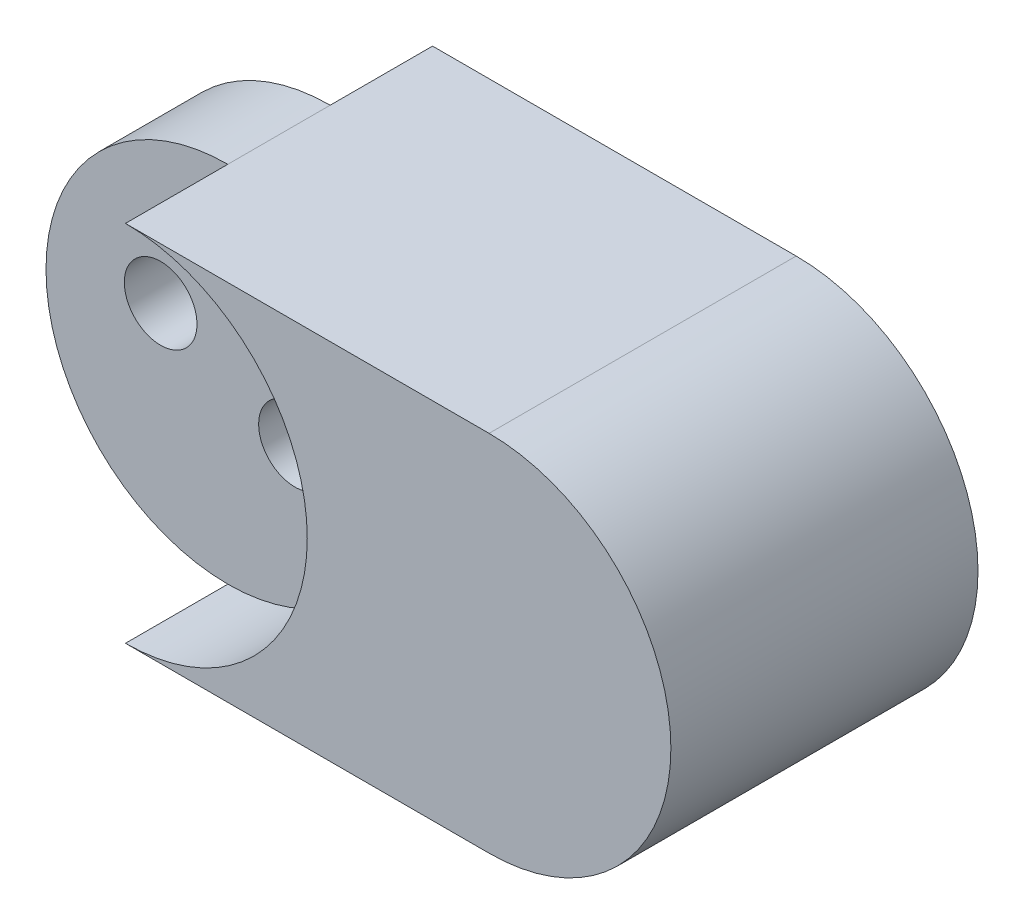
ISO-10303-21;
HEADER;
FILE_DESCRIPTION(('STEP AP214'),'2;1');
FILE_NAME('part.step','',(''),(''),'','','');
FILE_SCHEMA(('AUTOMOTIVE_DESIGN { 1 0 10303 214 1 1 1 1 }'));
ENDSEC;
DATA;
#1=APPLICATION_CONTEXT('core data for automotive mechanical design processes');
#2=APPLICATION_PROTOCOL_DEFINITION('international standard','automotive_design',2000,#1);
#3=PRODUCT_CONTEXT('',#1,'mechanical');
#4=PRODUCT('Part','Part','',(#3));
#5=PRODUCT_RELATED_PRODUCT_CATEGORY('part','',(#4));
#6=PRODUCT_DEFINITION_FORMATION('','',#4);
#7=PRODUCT_DEFINITION_CONTEXT('part definition',#1,'design');
#8=PRODUCT_DEFINITION('design','',#6,#7);
#9=PRODUCT_DEFINITION_SHAPE('','',#8);
#10=(LENGTH_UNIT() NAMED_UNIT(*) SI_UNIT(.MILLI.,.METRE.));
#11=(NAMED_UNIT(*) PLANE_ANGLE_UNIT() SI_UNIT($,.RADIAN.));
#12=(NAMED_UNIT(*) SI_UNIT($,.STERADIAN.) SOLID_ANGLE_UNIT());
#13=UNCERTAINTY_MEASURE_WITH_UNIT(LENGTH_MEASURE(1.E-05),#10,'distance_accuracy_value','');
#14=(GEOMETRIC_REPRESENTATION_CONTEXT(3) GLOBAL_UNCERTAINTY_ASSIGNED_CONTEXT((#13)) GLOBAL_UNIT_ASSIGNED_CONTEXT((#10,
#11,#12)) REPRESENTATION_CONTEXT('',''));
#15=CARTESIAN_POINT('',(0.,0.,0.));
#16=DIRECTION('',(0.,0.,1.));
#17=DIRECTION('',(1.,0.,0.));
#18=AXIS2_PLACEMENT_3D('',#15,#16,#17);
#19=CARTESIAN_POINT('',(-1.63988617020753,0.679263092448036,7.5));
#20=DIRECTION('',(0.,0.,-1.));
#21=DIRECTION('',(-1.,0.,0.));
#22=AXIS2_PLACEMENT_3D('',#19,#20,#21);
#23=CYLINDRICAL_SURFACE('',#22,4.44);
#24=DIRECTION('',(0.,0.,-1.));
#25=VECTOR('',#24,1.);
#26=CARTESIAN_POINT('',(-1.63988617020753,-3.76073690755197,7.5));
#27=LINE('',#26,#25);
#28=CARTESIAN_POINT('',(-1.63988617020753,-3.76073690755197,5.));
#29=VERTEX_POINT('',#28);
#30=CARTESIAN_POINT('',(-1.63988617020753,-3.76073690755197,2.5));
#31=VERTEX_POINT('',#30);
#32=EDGE_CURVE('E51',#29,#31,#27,.T.);
#33=ORIENTED_EDGE('',*,*,#32,.F.);
#34=CARTESIAN_POINT('',(-1.63988617020753,0.679263092448036,5.));
#35=DIRECTION('',(0.,0.,-1.));
#36=DIRECTION('',(-1.,0.,0.));
#37=AXIS2_PLACEMENT_3D('',#34,#35,#36);
#38=CIRCLE('',#37,4.44);
#39=CARTESIAN_POINT('',(-1.63988617020753,5.11926309244804,5.));
#40=VERTEX_POINT('',#39);
#41=EDGE_CURVE('E119',#29,#40,#38,.T.);
#42=ORIENTED_EDGE('',*,*,#41,.T.);
#43=DIRECTION('',(0.,0.,-1.));
#44=VECTOR('',#43,1.);
#45=CARTESIAN_POINT('',(-1.63988617020753,5.11926309244804,7.5));
#46=LINE('',#45,#44);
#47=CARTESIAN_POINT('',(-1.63988617020753,5.11926309244804,2.5));
#48=VERTEX_POINT('',#47);
#49=EDGE_CURVE('E58',#40,#48,#46,.T.);
#50=ORIENTED_EDGE('',*,*,#49,.T.);
#51=CARTESIAN_POINT('',(-1.63988617020753,0.679263092448036,2.5));
#52=DIRECTION('',(0.,0.,-1.));
#53=DIRECTION('',(-1.,0.,0.));
#54=AXIS2_PLACEMENT_3D('',#51,#52,#53);
#55=CIRCLE('',#54,4.44);
#56=EDGE_CURVE('E150',#31,#48,#55,.T.);
#57=ORIENTED_EDGE('',*,*,#56,.F.);
#58=EDGE_LOOP('',(#33,#42,#50,#57));
#59=FACE_BOUND('',#58,.T.);
#60=ADVANCED_FACE('F43',(#59),#23,.T.);
#61=CARTESIAN_POINT('',(0.,0.,7.5));
#62=DIRECTION('',(0.,0.,-1.));
#63=DIRECTION('',(-1.,0.,0.));
#64=AXIS2_PLACEMENT_3D('',#61,#62,#63);
#65=CYLINDRICAL_SURFACE('',#64,0.8875);
#66=CARTESIAN_POINT('',(0.,0.,5.));
#67=DIRECTION('',(0.,0.,-1.));
#68=DIRECTION('',(-1.,0.,0.));
#69=AXIS2_PLACEMENT_3D('',#66,#67,#68);
#70=CIRCLE('',#69,0.8875);
#71=CARTESIAN_POINT('',(-0.8875,0.,5.));
#72=VERTEX_POINT('',#71);
#73=EDGE_CURVE('E152',#72,#72,#70,.T.);
#74=ORIENTED_EDGE('',*,*,#73,.F.);
#75=EDGE_LOOP('',(#74));
#76=FACE_BOUND('',#75,.T.);
#77=CARTESIAN_POINT('',(0.,0.,2.5));
#78=DIRECTION('',(0.,0.,-1.));
#79=DIRECTION('',(-1.,0.,0.));
#80=AXIS2_PLACEMENT_3D('',#77,#78,#79);
#81=CIRCLE('',#80,0.8875);
#82=CARTESIAN_POINT('',(-0.8875,0.,2.5));
#83=VERTEX_POINT('',#82);
#84=EDGE_CURVE('E146',#83,#83,#81,.T.);
#85=ORIENTED_EDGE('',*,*,#84,.T.);
#86=EDGE_LOOP('',(#85));
#87=FACE_BOUND('',#86,.T.);
#88=ADVANCED_FACE('F177',(#76,#87),#65,.F.);
#89=CARTESIAN_POINT('',(-3.27977234041507,1.35852618489607,7.5));
#90=DIRECTION('',(0.,0.,-1.));
#91=DIRECTION('',(-1.,0.,0.));
#92=AXIS2_PLACEMENT_3D('',#89,#90,#91);
#93=CYLINDRICAL_SURFACE('',#92,0.8875);
#94=CARTESIAN_POINT('',(-3.27977234041507,1.35852618489607,5.));
#95=DIRECTION('',(0.,0.,-1.));
#96=DIRECTION('',(-1.,0.,0.));
#97=AXIS2_PLACEMENT_3D('',#94,#95,#96);
#98=CIRCLE('',#97,0.8875);
#99=CARTESIAN_POINT('',(-4.16727234041507,1.35852618489607,5.));
#100=VERTEX_POINT('',#99);
#101=EDGE_CURVE('E168',#100,#100,#98,.T.);
#102=ORIENTED_EDGE('',*,*,#101,.F.);
#103=EDGE_LOOP('',(#102));
#104=FACE_BOUND('',#103,.T.);
#105=CARTESIAN_POINT('',(-3.27977234041507,1.35852618489607,2.5));
#106=DIRECTION('',(0.,0.,-1.));
#107=DIRECTION('',(-1.,0.,0.));
#108=AXIS2_PLACEMENT_3D('',#105,#106,#107);
#109=CIRCLE('',#108,0.8875);
#110=CARTESIAN_POINT('',(-4.16727234041507,1.35852618489607,2.5));
#111=VERTEX_POINT('',#110);
#112=EDGE_CURVE('E46',#111,#111,#109,.T.);
#113=ORIENTED_EDGE('',*,*,#112,.T.);
#114=EDGE_LOOP('',(#113));
#115=FACE_BOUND('',#114,.T.);
#116=ADVANCED_FACE('F180',(#104,#115),#93,.F.);
#117=CARTESIAN_POINT('',(-1.63988617020753,0.679263092448036,7.5));
#118=DIRECTION('',(0.,0.,1.));
#119=DIRECTION('',(1.,0.,0.));
#120=AXIS2_PLACEMENT_3D('',#117,#118,#119);
#121=PLANE('',#120);
#122=CARTESIAN_POINT('',(-1.63988617020753,0.679263092448036,7.5));
#123=DIRECTION('',(0.,0.,-1.));
#124=DIRECTION('',(-1.,0.,0.));
#125=AXIS2_PLACEMENT_3D('',#122,#123,#124);
#126=CIRCLE('',#125,4.44);
#127=CARTESIAN_POINT('',(-1.63988617020753,5.11926309244804,7.5));
#128=VERTEX_POINT('',#127);
#129=CARTESIAN_POINT('',(-1.63988617020753,-3.76073690755197,7.5));
#130=VERTEX_POINT('',#129);
#131=EDGE_CURVE('E67',#128,#130,#126,.T.);
#132=ORIENTED_EDGE('',*,*,#131,.T.);
#133=DIRECTION('',(1.,0.,0.));
#134=VECTOR('',#133,1.);
#135=CARTESIAN_POINT('',(-1.63988617020753,-3.76073690755197,7.5));
#136=LINE('',#135,#134);
#137=CARTESIAN_POINT('',(7.24011382979247,-3.76073690755197,7.5));
#138=VERTEX_POINT('',#137);
#139=EDGE_CURVE('E88',#130,#138,#136,.T.);
#140=ORIENTED_EDGE('',*,*,#139,.T.);
#141=CARTESIAN_POINT('',(7.24011382979247,0.679263092448035,7.5));
#142=DIRECTION('',(0.,0.,1.));
#143=DIRECTION('',(1.,0.,0.));
#144=AXIS2_PLACEMENT_3D('',#141,#142,#143);
#145=CIRCLE('',#144,4.44);
#146=CARTESIAN_POINT('',(7.24011382979247,5.11926309244804,7.5));
#147=VERTEX_POINT('',#146);
#148=EDGE_CURVE('E160',#138,#147,#145,.T.);
#149=ORIENTED_EDGE('',*,*,#148,.T.);
#150=DIRECTION('',(-1.,0.,0.));
#151=VECTOR('',#150,1.);
#152=CARTESIAN_POINT('',(-1.63988617020753,5.11926309244804,7.5));
#153=LINE('',#152,#151);
#154=EDGE_CURVE('E124',#147,#128,#153,.T.);
#155=ORIENTED_EDGE('',*,*,#154,.T.);
#156=EDGE_LOOP('',(#132,#140,#149,#155));
#157=FACE_BOUND('',#156,.T.);
#158=ADVANCED_FACE('F167',(#157),#121,.T.);
#159=CARTESIAN_POINT('',(-1.63988617020753,0.679263092448036,0.));
#160=DIRECTION('',(0.,0.,1.));
#161=DIRECTION('',(1.,0.,0.));
#162=AXIS2_PLACEMENT_3D('',#159,#160,#161);
#163=PLANE('',#162);
#164=DIRECTION('',(1.,0.,0.));
#165=VECTOR('',#164,1.);
#166=CARTESIAN_POINT('',(-1.63988617020753,-3.76073690755197,0.));
#167=LINE('',#166,#165);
#168=CARTESIAN_POINT('',(-1.63988617020753,-3.76073690755197,0.));
#169=VERTEX_POINT('',#168);
#170=CARTESIAN_POINT('',(7.24011382979247,-3.76073690755197,0.));
#171=VERTEX_POINT('',#170);
#172=EDGE_CURVE('E145',#169,#171,#167,.T.);
#173=ORIENTED_EDGE('',*,*,#172,.F.);
#174=CARTESIAN_POINT('',(-1.63988617020753,0.679263092448036,0.));
#175=DIRECTION('',(0.,0.,-1.));
#176=DIRECTION('',(-1.,0.,0.));
#177=AXIS2_PLACEMENT_3D('',#174,#175,#176);
#178=CIRCLE('',#177,4.44);
#179=CARTESIAN_POINT('',(-1.63988617020753,5.11926309244804,0.));
#180=VERTEX_POINT('',#179);
#181=EDGE_CURVE('E144',#180,#169,#178,.T.);
#182=ORIENTED_EDGE('',*,*,#181,.F.);
#183=DIRECTION('',(-1.,0.,0.));
#184=VECTOR('',#183,1.);
#185=CARTESIAN_POINT('',(-1.63988617020753,5.11926309244804,0.));
#186=LINE('',#185,#184);
#187=CARTESIAN_POINT('',(7.24011382979247,5.11926309244804,0.));
#188=VERTEX_POINT('',#187);
#189=EDGE_CURVE('E127',#188,#180,#186,.T.);
#190=ORIENTED_EDGE('',*,*,#189,.F.);
#191=CARTESIAN_POINT('',(7.24011382979247,0.679263092448035,0.));
#192=DIRECTION('',(0.,0.,1.));
#193=DIRECTION('',(1.,0.,0.));
#194=AXIS2_PLACEMENT_3D('',#191,#192,#193);
#195=CIRCLE('',#194,4.44);
#196=EDGE_CURVE('E83',#171,#188,#195,.T.);
#197=ORIENTED_EDGE('',*,*,#196,.F.);
#198=EDGE_LOOP('',(#173,#182,#190,#197));
#199=FACE_BOUND('',#198,.T.);
#200=ADVANCED_FACE('F165',(#199),#163,.F.);
#201=CARTESIAN_POINT('',(-1.63988617020753,-3.76073690755197,7.5));
#202=DIRECTION('',(0.,1.,0.));
#203=DIRECTION('',(0.,0.,1.));
#204=AXIS2_PLACEMENT_3D('',#201,#202,#203);
#205=PLANE('',#204);
#206=ORIENTED_EDGE('',*,*,#172,.T.);
#207=DIRECTION('',(0.,0.,-1.));
#208=VECTOR('',#207,1.);
#209=CARTESIAN_POINT('',(7.24011382979247,-3.76073690755197,7.5));
#210=LINE('',#209,#208);
#211=EDGE_CURVE('E130',#138,#171,#210,.T.);
#212=ORIENTED_EDGE('',*,*,#211,.F.);
#213=ORIENTED_EDGE('',*,*,#139,.F.);
#214=EDGE_CURVE('E11',#130,#29,#27,.T.);
#215=ORIENTED_EDGE('',*,*,#214,.T.);
#216=ORIENTED_EDGE('',*,*,#32,.T.);
#217=DIRECTION('',(0.,0.,-1.));
#218=VECTOR('',#217,1.);
#219=CARTESIAN_POINT('',(-1.63988617020753,-3.76073690755197,2.5));
#220=LINE('',#219,#218);
#221=EDGE_CURVE('E136',#31,#169,#220,.T.);
#222=ORIENTED_EDGE('',*,*,#221,.T.);
#223=EDGE_LOOP('',(#206,#212,#213,#215,#216,#222));
#224=FACE_BOUND('',#223,.T.);
#225=ADVANCED_FACE('F135',(#224),#205,.F.);
#226=CARTESIAN_POINT('',(7.24011382979247,0.679263092448035,7.5));
#227=DIRECTION('',(0.,0.,-1.));
#228=DIRECTION('',(-1.,0.,0.));
#229=AXIS2_PLACEMENT_3D('',#226,#227,#228);
#230=CYLINDRICAL_SURFACE('',#229,4.44);
#231=ORIENTED_EDGE('',*,*,#196,.T.);
#232=DIRECTION('',(0.,0.,-1.));
#233=VECTOR('',#232,1.);
#234=CARTESIAN_POINT('',(7.24011382979247,5.11926309244804,7.5));
#235=LINE('',#234,#233);
#236=EDGE_CURVE('E114',#147,#188,#235,.T.);
#237=ORIENTED_EDGE('',*,*,#236,.F.);
#238=ORIENTED_EDGE('',*,*,#148,.F.);
#239=ORIENTED_EDGE('',*,*,#211,.T.);
#240=EDGE_LOOP('',(#231,#237,#238,#239));
#241=FACE_BOUND('',#240,.T.);
#242=ADVANCED_FACE('F166',(#241),#230,.T.);
#243=CARTESIAN_POINT('',(-1.63988617020753,5.11926309244804,7.5));
#244=DIRECTION('',(0.,-1.,0.));
#245=DIRECTION('',(0.,0.,-1.));
#246=AXIS2_PLACEMENT_3D('',#243,#244,#245);
#247=PLANE('',#246);
#248=ORIENTED_EDGE('',*,*,#189,.T.);
#249=EDGE_CURVE('E116',#48,#180,#46,.T.);
#250=ORIENTED_EDGE('',*,*,#249,.F.);
#251=ORIENTED_EDGE('',*,*,#49,.F.);
#252=EDGE_CURVE('E107',#128,#40,#46,.T.);
#253=ORIENTED_EDGE('',*,*,#252,.F.);
#254=ORIENTED_EDGE('',*,*,#154,.F.);
#255=ORIENTED_EDGE('',*,*,#236,.T.);
#256=EDGE_LOOP('',(#248,#250,#251,#253,#254,#255));
#257=FACE_BOUND('',#256,.T.);
#258=ADVANCED_FACE('F123',(#257),#247,.F.);
#259=CARTESIAN_POINT('',(-1.63988617020753,0.679263092448036,2.5));
#260=DIRECTION('',(0.,0.,-1.));
#261=DIRECTION('',(-1.,0.,0.));
#262=AXIS2_PLACEMENT_3D('',#259,#260,#261);
#263=CYLINDRICAL_SURFACE('',#262,4.44);
#264=EDGE_CURVE('E141',#48,#31,#55,.T.);
#265=ORIENTED_EDGE('',*,*,#264,.F.);
#266=ORIENTED_EDGE('',*,*,#249,.T.);
#267=ORIENTED_EDGE('',*,*,#181,.T.);
#268=ORIENTED_EDGE('',*,*,#221,.F.);
#269=EDGE_LOOP('',(#265,#266,#267,#268));
#270=FACE_BOUND('',#269,.T.);
#271=ADVANCED_FACE('F140',(#270),#263,.F.);
#272=CARTESIAN_POINT('',(-1.63988617020753,0.679263092448036,2.5));
#273=DIRECTION('',(0.,0.,-1.));
#274=DIRECTION('',(-1.,0.,0.));
#275=AXIS2_PLACEMENT_3D('',#272,#273,#274);
#276=PLANE('',#275);
#277=ORIENTED_EDGE('',*,*,#84,.F.);
#278=EDGE_LOOP('',(#277));
#279=FACE_BOUND('',#278,.T.);
#280=ORIENTED_EDGE('',*,*,#112,.F.);
#281=EDGE_LOOP('',(#280));
#282=FACE_BOUND('',#281,.T.);
#283=ORIENTED_EDGE('',*,*,#264,.T.);
#284=ORIENTED_EDGE('',*,*,#56,.T.);
#285=EDGE_LOOP('',(#283,#284));
#286=FACE_BOUND('',#285,.T.);
#287=ADVANCED_FACE('F149',(#279,#282,#286),#276,.T.);
#288=CARTESIAN_POINT('',(-1.63988617020753,0.679263092448036,7.5));
#289=DIRECTION('',(0.,0.,-1.));
#290=DIRECTION('',(-1.,0.,0.));
#291=AXIS2_PLACEMENT_3D('',#288,#289,#290);
#292=CYLINDRICAL_SURFACE('',#291,4.44);
#293=ORIENTED_EDGE('',*,*,#131,.F.);
#294=ORIENTED_EDGE('',*,*,#252,.T.);
#295=EDGE_CURVE('E110',#40,#29,#38,.T.);
#296=ORIENTED_EDGE('',*,*,#295,.T.);
#297=ORIENTED_EDGE('',*,*,#214,.F.);
#298=EDGE_LOOP('',(#293,#294,#296,#297));
#299=FACE_BOUND('',#298,.T.);
#300=ADVANCED_FACE('F109',(#299),#292,.F.);
#301=CARTESIAN_POINT('',(-1.63988617020753,0.679263092448036,5.));
#302=DIRECTION('',(0.,0.,-1.));
#303=DIRECTION('',(-1.,0.,0.));
#304=AXIS2_PLACEMENT_3D('',#301,#302,#303);
#305=PLANE('',#304);
#306=ORIENTED_EDGE('',*,*,#73,.T.);
#307=EDGE_LOOP('',(#306));
#308=FACE_BOUND('',#307,.T.);
#309=ORIENTED_EDGE('',*,*,#101,.T.);
#310=EDGE_LOOP('',(#309));
#311=FACE_BOUND('',#310,.T.);
#312=ORIENTED_EDGE('',*,*,#295,.F.);
#313=ORIENTED_EDGE('',*,*,#41,.F.);
#314=EDGE_LOOP('',(#312,#313));
#315=FACE_BOUND('',#314,.T.);
#316=ADVANCED_FACE('F118',(#308,#311,#315),#305,.F.);
#317=CLOSED_SHELL('',(#60,#88,#116,#158,#200,#225,#242,#258,#271,#287,#300,#316));
#318=MANIFOLD_SOLID_BREP('B2',#317);
#319=ADVANCED_BREP_SHAPE_REPRESENTATION('',(#18,#318),#14);
#320=SHAPE_DEFINITION_REPRESENTATION(#9,#319);
ENDSEC;
END-ISO-10303-21;
